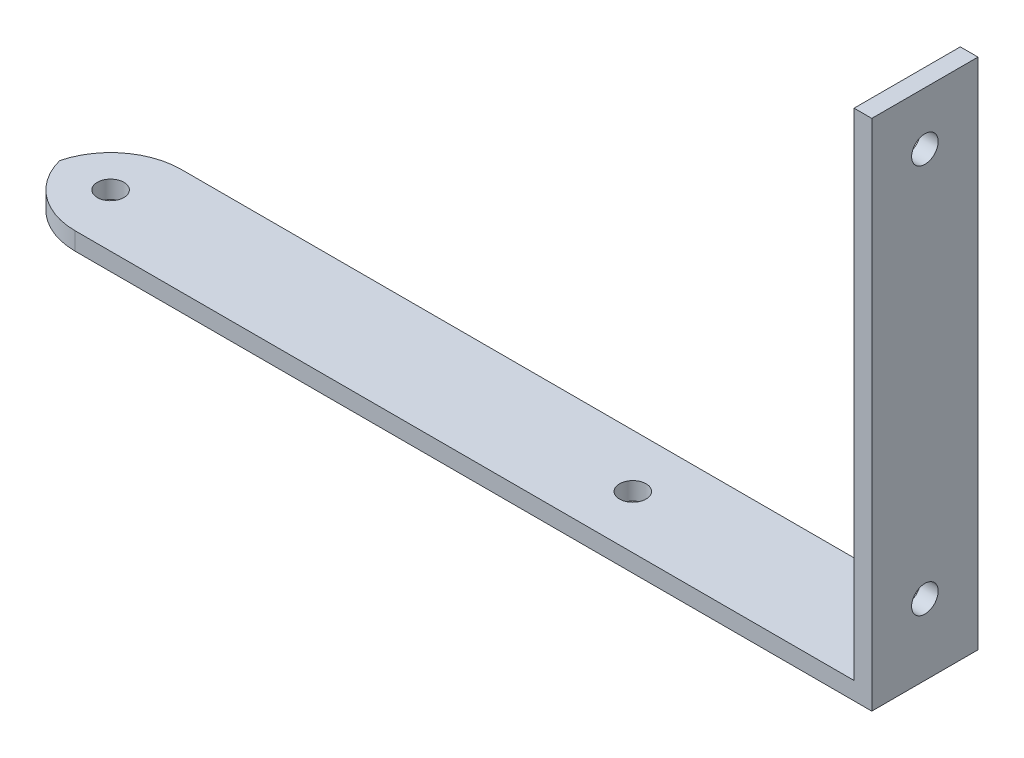
ISO-10303-21;
HEADER;
FILE_DESCRIPTION(('STEP AP214'),'2;1');
FILE_NAME('part.step','',(''),(''),'','','');
FILE_SCHEMA(('AUTOMOTIVE_DESIGN { 1 0 10303 214 1 1 1 1 }'));
ENDSEC;
DATA;
#1=APPLICATION_CONTEXT('core data for automotive mechanical design processes');
#2=APPLICATION_PROTOCOL_DEFINITION('international standard','automotive_design',2000,#1);
#3=PRODUCT_CONTEXT('',#1,'mechanical');
#4=PRODUCT('Part','Part','',(#3));
#5=PRODUCT_RELATED_PRODUCT_CATEGORY('part','',(#4));
#6=PRODUCT_DEFINITION_FORMATION('','',#4);
#7=PRODUCT_DEFINITION_CONTEXT('part definition',#1,'design');
#8=PRODUCT_DEFINITION('design','',#6,#7);
#9=PRODUCT_DEFINITION_SHAPE('','',#8);
#10=(LENGTH_UNIT() NAMED_UNIT(*) SI_UNIT(.MILLI.,.METRE.));
#11=(NAMED_UNIT(*) PLANE_ANGLE_UNIT() SI_UNIT($,.RADIAN.));
#12=(NAMED_UNIT(*) SI_UNIT($,.STERADIAN.) SOLID_ANGLE_UNIT());
#13=UNCERTAINTY_MEASURE_WITH_UNIT(LENGTH_MEASURE(1.E-05),#10,'distance_accuracy_value','');
#14=(GEOMETRIC_REPRESENTATION_CONTEXT(3) GLOBAL_UNCERTAINTY_ASSIGNED_CONTEXT((#13)) GLOBAL_UNIT_ASSIGNED_CONTEXT((#10,
#11,#12)) REPRESENTATION_CONTEXT('',''));
#15=CARTESIAN_POINT('',(0.,0.,0.));
#16=DIRECTION('',(0.,0.,1.));
#17=DIRECTION('',(1.,0.,0.));
#18=AXIS2_PLACEMENT_3D('',#15,#16,#17);
#19=CARTESIAN_POINT('',(0.,2.,0.));
#20=DIRECTION('',(0.,-1.,0.));
#21=DIRECTION('',(0.,0.,-1.));
#22=AXIS2_PLACEMENT_3D('',#19,#20,#21);
#23=PLANE('',#22);
#24=CARTESIAN_POINT('',(65.,2.,-6.));
#25=DIRECTION('',(0.,1.,0.));
#26=DIRECTION('',(0.,0.,1.));
#27=AXIS2_PLACEMENT_3D('',#24,#25,#26);
#28=CIRCLE('',#27,1.5);
#29=CARTESIAN_POINT('',(65.,2.,-4.5));
#30=VERTEX_POINT('',#29);
#31=EDGE_CURVE('E175',#30,#30,#28,.T.);
#32=ORIENTED_EDGE('',*,*,#31,.F.);
#33=EDGE_LOOP('',(#32));
#34=FACE_BOUND('',#33,.T.);
#35=CARTESIAN_POINT('',(6.,2.,-6.));
#36=DIRECTION('',(0.,1.,0.));
#37=DIRECTION('',(0.,0.,1.));
#38=AXIS2_PLACEMENT_3D('',#35,#36,#37);
#39=CIRCLE('',#38,1.5);
#40=CARTESIAN_POINT('',(6.,2.,-4.5));
#41=VERTEX_POINT('',#40);
#42=EDGE_CURVE('E123',#41,#41,#39,.T.);
#43=ORIENTED_EDGE('',*,*,#42,.F.);
#44=EDGE_LOOP('',(#43));
#45=FACE_BOUND('',#44,.T.);
#46=DIRECTION('',(-1.,0.,0.));
#47=VECTOR('',#46,1.);
#48=CARTESIAN_POINT('',(0.,2.,-12.));
#49=LINE('',#48,#47);
#50=CARTESIAN_POINT('',(96.,2.,-12.));
#51=VERTEX_POINT('',#50);
#52=CARTESIAN_POINT('',(8.,2.,-12.));
#53=VERTEX_POINT('',#52);
#54=EDGE_CURVE('E101',#51,#53,#49,.T.);
#55=ORIENTED_EDGE('',*,*,#54,.T.);
#56=CARTESIAN_POINT('',(8.,2.,-4.));
#57=DIRECTION('',(0.,-1.,0.));
#58=DIRECTION('',(0.,0.,-1.));
#59=AXIS2_PLACEMENT_3D('',#56,#57,#58);
#60=CIRCLE('',#59,8.);
#61=CARTESIAN_POINT('',(0.254033307585167,2.,-6.));
#62=VERTEX_POINT('',#61);
#63=EDGE_CURVE('E42',#53,#62,#60,.F.);
#64=ORIENTED_EDGE('',*,*,#63,.T.);
#65=CARTESIAN_POINT('',(8.,2.,-8.));
#66=DIRECTION('',(0.,-1.,0.));
#67=DIRECTION('',(0.,0.,-1.));
#68=AXIS2_PLACEMENT_3D('',#65,#66,#67);
#69=CIRCLE('',#68,8.);
#70=CARTESIAN_POINT('',(8.,2.,0.));
#71=VERTEX_POINT('',#70);
#72=EDGE_CURVE('E52',#62,#71,#69,.F.);
#73=ORIENTED_EDGE('',*,*,#72,.T.);
#74=DIRECTION('',(1.,0.,0.));
#75=VECTOR('',#74,1.);
#76=CARTESIAN_POINT('',(0.,2.,0.));
#77=LINE('',#76,#75);
#78=CARTESIAN_POINT('',(96.,2.,0.));
#79=VERTEX_POINT('',#78);
#80=EDGE_CURVE('E151',#71,#79,#77,.T.);
#81=ORIENTED_EDGE('',*,*,#80,.T.);
#82=DIRECTION('',(0.,0.,1.));
#83=VECTOR('',#82,1.);
#84=CARTESIAN_POINT('',(96.,2.,0.));
#85=LINE('',#84,#83);
#86=EDGE_CURVE('E117',#51,#79,#85,.T.);
#87=ORIENTED_EDGE('',*,*,#86,.F.);
#88=EDGE_LOOP('',(#55,#64,#73,#81,#87));
#89=FACE_BOUND('',#88,.T.);
#90=ADVANCED_FACE('F33',(#34,#45,#89),#23,.F.);
#91=CARTESIAN_POINT('',(0.,2.,0.));
#92=DIRECTION('',(0.,0.,-1.));
#93=DIRECTION('',(-1.,0.,0.));
#94=AXIS2_PLACEMENT_3D('',#91,#92,#93);
#95=PLANE('',#94);
#96=ORIENTED_EDGE('',*,*,#80,.F.);
#97=DIRECTION('',(0.,-1.,0.));
#98=VECTOR('',#97,1.);
#99=CARTESIAN_POINT('',(8.,2.,0.));
#100=LINE('',#99,#98);
#101=CARTESIAN_POINT('',(8.,0.,0.));
#102=VERTEX_POINT('',#101);
#103=EDGE_CURVE('E11',#71,#102,#100,.T.);
#104=ORIENTED_EDGE('',*,*,#103,.T.);
#105=DIRECTION('',(1.,0.,0.));
#106=VECTOR('',#105,1.);
#107=CARTESIAN_POINT('',(0.,0.,0.));
#108=LINE('',#107,#106);
#109=CARTESIAN_POINT('',(98.,0.,0.));
#110=VERTEX_POINT('',#109);
#111=EDGE_CURVE('E141',#102,#110,#108,.T.);
#112=ORIENTED_EDGE('',*,*,#111,.T.);
#113=DIRECTION('',(0.,-1.,0.));
#114=VECTOR('',#113,1.);
#115=CARTESIAN_POINT('',(98.,2.,0.));
#116=LINE('',#115,#114);
#117=CARTESIAN_POINT('',(98.,58.,0.));
#118=VERTEX_POINT('',#117);
#119=EDGE_CURVE('E100',#118,#110,#116,.T.);
#120=ORIENTED_EDGE('',*,*,#119,.F.);
#121=DIRECTION('',(1.,0.,0.));
#122=VECTOR('',#121,1.);
#123=CARTESIAN_POINT('',(98.,58.,0.));
#124=LINE('',#123,#122);
#125=CARTESIAN_POINT('',(96.,58.,0.));
#126=VERTEX_POINT('',#125);
#127=EDGE_CURVE('E116',#126,#118,#124,.T.);
#128=ORIENTED_EDGE('',*,*,#127,.F.);
#129=DIRECTION('',(0.,-1.,0.));
#130=VECTOR('',#129,1.);
#131=CARTESIAN_POINT('',(96.,58.,0.));
#132=LINE('',#131,#130);
#133=EDGE_CURVE('E128',#126,#79,#132,.T.);
#134=ORIENTED_EDGE('',*,*,#133,.T.);
#135=EDGE_LOOP('',(#96,#104,#112,#120,#128,#134));
#136=FACE_BOUND('',#135,.T.);
#137=ADVANCED_FACE('F172',(#136),#95,.F.);
#138=CARTESIAN_POINT('',(98.,2.,0.));
#139=DIRECTION('',(-1.,0.,0.));
#140=DIRECTION('',(0.,0.,1.));
#141=AXIS2_PLACEMENT_3D('',#138,#139,#140);
#142=PLANE('',#141);
#143=CARTESIAN_POINT('',(98.,52.,-6.));
#144=DIRECTION('',(-1.,0.,0.));
#145=DIRECTION('',(0.,0.,1.));
#146=AXIS2_PLACEMENT_3D('',#143,#144,#145);
#147=CIRCLE('',#146,1.5);
#148=CARTESIAN_POINT('',(98.,52.,-4.5));
#149=VERTEX_POINT('',#148);
#150=EDGE_CURVE('E186',#149,#149,#147,.T.);
#151=ORIENTED_EDGE('',*,*,#150,.T.);
#152=EDGE_LOOP('',(#151));
#153=FACE_BOUND('',#152,.T.);
#154=CARTESIAN_POINT('',(98.,8.,-6.));
#155=DIRECTION('',(-1.,0.,0.));
#156=DIRECTION('',(0.,0.,1.));
#157=AXIS2_PLACEMENT_3D('',#154,#155,#156);
#158=CIRCLE('',#157,1.5);
#159=CARTESIAN_POINT('',(98.,8.,-4.5));
#160=VERTEX_POINT('',#159);
#161=EDGE_CURVE('E176',#160,#160,#158,.T.);
#162=ORIENTED_EDGE('',*,*,#161,.T.);
#163=EDGE_LOOP('',(#162));
#164=FACE_BOUND('',#163,.T.);
#165=DIRECTION('',(0.,0.,-1.));
#166=VECTOR('',#165,1.);
#167=CARTESIAN_POINT('',(98.,0.,0.));
#168=LINE('',#167,#166);
#169=CARTESIAN_POINT('',(98.,0.,-12.));
#170=VERTEX_POINT('',#169);
#171=EDGE_CURVE('E96',#110,#170,#168,.T.);
#172=ORIENTED_EDGE('',*,*,#171,.T.);
#173=DIRECTION('',(0.,-1.,0.));
#174=VECTOR('',#173,1.);
#175=CARTESIAN_POINT('',(98.,2.,-12.));
#176=LINE('',#175,#174);
#177=CARTESIAN_POINT('',(98.,58.,-12.));
#178=VERTEX_POINT('',#177);
#179=EDGE_CURVE('E89',#178,#170,#176,.T.);
#180=ORIENTED_EDGE('',*,*,#179,.F.);
#181=DIRECTION('',(0.,0.,-1.));
#182=VECTOR('',#181,1.);
#183=CARTESIAN_POINT('',(98.,58.,0.));
#184=LINE('',#183,#182);
#185=EDGE_CURVE('E94',#118,#178,#184,.T.);
#186=ORIENTED_EDGE('',*,*,#185,.F.);
#187=ORIENTED_EDGE('',*,*,#119,.T.);
#188=EDGE_LOOP('',(#172,#180,#186,#187));
#189=FACE_BOUND('',#188,.T.);
#190=ADVANCED_FACE('F91',(#153,#164,#189),#142,.F.);
#191=CARTESIAN_POINT('',(0.,2.,-12.));
#192=DIRECTION('',(0.,0.,1.));
#193=DIRECTION('',(1.,0.,0.));
#194=AXIS2_PLACEMENT_3D('',#191,#192,#193);
#195=PLANE('',#194);
#196=DIRECTION('',(-1.,0.,0.));
#197=VECTOR('',#196,1.);
#198=CARTESIAN_POINT('',(0.,0.,-12.));
#199=LINE('',#198,#197);
#200=CARTESIAN_POINT('',(8.,0.,-12.));
#201=VERTEX_POINT('',#200);
#202=EDGE_CURVE('E153',#170,#201,#199,.T.);
#203=ORIENTED_EDGE('',*,*,#202,.T.);
#204=DIRECTION('',(0.,-1.,0.));
#205=VECTOR('',#204,1.);
#206=CARTESIAN_POINT('',(8.,2.,-12.));
#207=LINE('',#206,#205);
#208=EDGE_CURVE('E148',#201,#53,#207,.F.);
#209=ORIENTED_EDGE('',*,*,#208,.T.);
#210=ORIENTED_EDGE('',*,*,#54,.F.);
#211=DIRECTION('',(0.,-1.,0.));
#212=VECTOR('',#211,1.);
#213=CARTESIAN_POINT('',(96.,58.,-12.));
#214=LINE('',#213,#212);
#215=CARTESIAN_POINT('',(96.,58.,-12.));
#216=VERTEX_POINT('',#215);
#217=EDGE_CURVE('E108',#216,#51,#214,.T.);
#218=ORIENTED_EDGE('',*,*,#217,.F.);
#219=DIRECTION('',(-1.,0.,0.));
#220=VECTOR('',#219,1.);
#221=CARTESIAN_POINT('',(98.,58.,-12.));
#222=LINE('',#221,#220);
#223=EDGE_CURVE('E104',#178,#216,#222,.T.);
#224=ORIENTED_EDGE('',*,*,#223,.F.);
#225=ORIENTED_EDGE('',*,*,#179,.T.);
#226=EDGE_LOOP('',(#203,#209,#210,#218,#224,#225));
#227=FACE_BOUND('',#226,.T.);
#228=ADVANCED_FACE('F105',(#227),#195,.F.);
#229=CARTESIAN_POINT('',(0.,0.,0.));
#230=DIRECTION('',(0.,-1.,0.));
#231=DIRECTION('',(0.,0.,-1.));
#232=AXIS2_PLACEMENT_3D('',#229,#230,#231);
#233=PLANE('',#232);
#234=CARTESIAN_POINT('',(65.,0.,-6.));
#235=DIRECTION('',(0.,1.,0.));
#236=DIRECTION('',(0.,0.,1.));
#237=AXIS2_PLACEMENT_3D('',#234,#235,#236);
#238=CIRCLE('',#237,1.5);
#239=CARTESIAN_POINT('',(65.,0.,-4.5));
#240=VERTEX_POINT('',#239);
#241=EDGE_CURVE('E178',#240,#240,#238,.T.);
#242=ORIENTED_EDGE('',*,*,#241,.T.);
#243=EDGE_LOOP('',(#242));
#244=FACE_BOUND('',#243,.T.);
#245=CARTESIAN_POINT('',(6.,0.,-6.));
#246=DIRECTION('',(0.,1.,0.));
#247=DIRECTION('',(0.,0.,1.));
#248=AXIS2_PLACEMENT_3D('',#245,#246,#247);
#249=CIRCLE('',#248,1.5);
#250=CARTESIAN_POINT('',(6.,0.,-4.5));
#251=VERTEX_POINT('',#250);
#252=EDGE_CURVE('E120',#251,#251,#249,.T.);
#253=ORIENTED_EDGE('',*,*,#252,.T.);
#254=EDGE_LOOP('',(#253));
#255=FACE_BOUND('',#254,.T.);
#256=CARTESIAN_POINT('',(8.,0.,-8.));
#257=DIRECTION('',(0.,-1.,0.));
#258=DIRECTION('',(0.,0.,-1.));
#259=AXIS2_PLACEMENT_3D('',#256,#257,#258);
#260=CIRCLE('',#259,8.);
#261=CARTESIAN_POINT('',(0.254033307585167,0.,-6.));
#262=VERTEX_POINT('',#261);
#263=EDGE_CURVE('E144',#102,#262,#260,.T.);
#264=ORIENTED_EDGE('',*,*,#263,.T.);
#265=CARTESIAN_POINT('',(8.,0.,-4.));
#266=DIRECTION('',(0.,-1.,0.));
#267=DIRECTION('',(0.,0.,-1.));
#268=AXIS2_PLACEMENT_3D('',#265,#266,#267);
#269=CIRCLE('',#268,8.);
#270=EDGE_CURVE('E146',#262,#201,#269,.T.);
#271=ORIENTED_EDGE('',*,*,#270,.T.);
#272=ORIENTED_EDGE('',*,*,#202,.F.);
#273=ORIENTED_EDGE('',*,*,#171,.F.);
#274=ORIENTED_EDGE('',*,*,#111,.F.);
#275=EDGE_LOOP('',(#264,#271,#272,#273,#274));
#276=FACE_BOUND('',#275,.T.);
#277=ADVANCED_FACE('F162',(#244,#255,#276),#233,.T.);
#278=CARTESIAN_POINT('',(96.,58.,0.));
#279=DIRECTION('',(1.,0.,0.));
#280=DIRECTION('',(0.,0.,-1.));
#281=AXIS2_PLACEMENT_3D('',#278,#279,#280);
#282=PLANE('',#281);
#283=CARTESIAN_POINT('',(96.,52.,-6.));
#284=DIRECTION('',(-1.,0.,0.));
#285=DIRECTION('',(0.,0.,1.));
#286=AXIS2_PLACEMENT_3D('',#283,#284,#285);
#287=CIRCLE('',#286,1.5);
#288=CARTESIAN_POINT('',(96.,52.,-4.5));
#289=VERTEX_POINT('',#288);
#290=EDGE_CURVE('E189',#289,#289,#287,.T.);
#291=ORIENTED_EDGE('',*,*,#290,.F.);
#292=EDGE_LOOP('',(#291));
#293=FACE_BOUND('',#292,.T.);
#294=CARTESIAN_POINT('',(96.,8.,-6.));
#295=DIRECTION('',(-1.,0.,0.));
#296=DIRECTION('',(0.,0.,1.));
#297=AXIS2_PLACEMENT_3D('',#294,#295,#296);
#298=CIRCLE('',#297,1.5);
#299=CARTESIAN_POINT('',(96.,8.,-4.5));
#300=VERTEX_POINT('',#299);
#301=EDGE_CURVE('E181',#300,#300,#298,.T.);
#302=ORIENTED_EDGE('',*,*,#301,.F.);
#303=EDGE_LOOP('',(#302));
#304=FACE_BOUND('',#303,.T.);
#305=ORIENTED_EDGE('',*,*,#86,.T.);
#306=ORIENTED_EDGE('',*,*,#133,.F.);
#307=DIRECTION('',(0.,0.,1.));
#308=VECTOR('',#307,1.);
#309=CARTESIAN_POINT('',(96.,58.,0.));
#310=LINE('',#309,#308);
#311=EDGE_CURVE('E111',#216,#126,#310,.T.);
#312=ORIENTED_EDGE('',*,*,#311,.F.);
#313=ORIENTED_EDGE('',*,*,#217,.T.);
#314=EDGE_LOOP('',(#305,#306,#312,#313));
#315=FACE_BOUND('',#314,.T.);
#316=ADVANCED_FACE('F171',(#293,#304,#315),#282,.F.);
#317=CARTESIAN_POINT('',(0.,58.,0.));
#318=DIRECTION('',(0.,1.,0.));
#319=DIRECTION('',(0.,0.,1.));
#320=AXIS2_PLACEMENT_3D('',#317,#318,#319);
#321=PLANE('',#320);
#322=ORIENTED_EDGE('',*,*,#185,.T.);
#323=ORIENTED_EDGE('',*,*,#223,.T.);
#324=ORIENTED_EDGE('',*,*,#311,.T.);
#325=ORIENTED_EDGE('',*,*,#127,.T.);
#326=EDGE_LOOP('',(#322,#323,#324,#325));
#327=FACE_BOUND('',#326,.T.);
#328=ADVANCED_FACE('F114',(#327),#321,.T.);
#329=CARTESIAN_POINT('',(6.,0.,-6.));
#330=DIRECTION('',(0.,1.,0.));
#331=DIRECTION('',(0.,0.,1.));
#332=AXIS2_PLACEMENT_3D('',#329,#330,#331);
#333=CYLINDRICAL_SURFACE('',#332,1.5);
#334=ORIENTED_EDGE('',*,*,#252,.F.);
#335=EDGE_LOOP('',(#334));
#336=FACE_BOUND('',#335,.T.);
#337=ORIENTED_EDGE('',*,*,#42,.T.);
#338=EDGE_LOOP('',(#337));
#339=FACE_BOUND('',#338,.T.);
#340=ADVANCED_FACE('F199',(#336,#339),#333,.F.);
#341=CARTESIAN_POINT('',(65.,0.,-6.));
#342=DIRECTION('',(0.,1.,0.));
#343=DIRECTION('',(0.,0.,1.));
#344=AXIS2_PLACEMENT_3D('',#341,#342,#343);
#345=CYLINDRICAL_SURFACE('',#344,1.5);
#346=ORIENTED_EDGE('',*,*,#241,.F.);
#347=EDGE_LOOP('',(#346));
#348=FACE_BOUND('',#347,.T.);
#349=ORIENTED_EDGE('',*,*,#31,.T.);
#350=EDGE_LOOP('',(#349));
#351=FACE_BOUND('',#350,.T.);
#352=ADVANCED_FACE('F228',(#348,#351),#345,.F.);
#353=CARTESIAN_POINT('',(8.,2.,-8.));
#354=DIRECTION('',(0.,-1.,0.));
#355=DIRECTION('',(0.,0.,-1.));
#356=AXIS2_PLACEMENT_3D('',#353,#354,#355);
#357=CYLINDRICAL_SURFACE('',#356,8.);
#358=ORIENTED_EDGE('',*,*,#103,.F.);
#359=ORIENTED_EDGE('',*,*,#72,.F.);
#360=DIRECTION('',(0.,-1.,0.));
#361=VECTOR('',#360,1.);
#362=CARTESIAN_POINT('',(0.254033307585167,1.,-6.));
#363=LINE('',#362,#361);
#364=EDGE_CURVE('E37',#262,#62,#363,.F.);
#365=ORIENTED_EDGE('',*,*,#364,.F.);
#366=ORIENTED_EDGE('',*,*,#263,.F.);
#367=EDGE_LOOP('',(#358,#359,#365,#366));
#368=FACE_BOUND('',#367,.T.);
#369=ADVANCED_FACE('F35',(#368),#357,.T.);
#370=CARTESIAN_POINT('',(8.,2.,-4.));
#371=DIRECTION('',(0.,-1.,0.));
#372=DIRECTION('',(0.,0.,-1.));
#373=AXIS2_PLACEMENT_3D('',#370,#371,#372);
#374=CYLINDRICAL_SURFACE('',#373,8.);
#375=ORIENTED_EDGE('',*,*,#63,.F.);
#376=ORIENTED_EDGE('',*,*,#208,.F.);
#377=ORIENTED_EDGE('',*,*,#270,.F.);
#378=ORIENTED_EDGE('',*,*,#364,.T.);
#379=EDGE_LOOP('',(#375,#376,#377,#378));
#380=FACE_BOUND('',#379,.T.);
#381=ADVANCED_FACE('F168',(#380),#374,.T.);
#382=CARTESIAN_POINT('',(98.,8.,-6.));
#383=DIRECTION('',(-1.,0.,0.));
#384=DIRECTION('',(0.,0.,1.));
#385=AXIS2_PLACEMENT_3D('',#382,#383,#384);
#386=CYLINDRICAL_SURFACE('',#385,1.5);
#387=ORIENTED_EDGE('',*,*,#161,.F.);
#388=EDGE_LOOP('',(#387));
#389=FACE_BOUND('',#388,.T.);
#390=ORIENTED_EDGE('',*,*,#301,.T.);
#391=EDGE_LOOP('',(#390));
#392=FACE_BOUND('',#391,.T.);
#393=ADVANCED_FACE('F220',(#389,#392),#386,.F.);
#394=CARTESIAN_POINT('',(98.,52.,-6.));
#395=DIRECTION('',(-1.,0.,0.));
#396=DIRECTION('',(0.,0.,1.));
#397=AXIS2_PLACEMENT_3D('',#394,#395,#396);
#398=CYLINDRICAL_SURFACE('',#397,1.5);
#399=ORIENTED_EDGE('',*,*,#150,.F.);
#400=EDGE_LOOP('',(#399));
#401=FACE_BOUND('',#400,.T.);
#402=ORIENTED_EDGE('',*,*,#290,.T.);
#403=EDGE_LOOP('',(#402));
#404=FACE_BOUND('',#403,.T.);
#405=ADVANCED_FACE('F225',(#401,#404),#398,.F.);
#406=CLOSED_SHELL('',(#90,#137,#190,#228,#277,#316,#328,#340,#352,#369,#381,#393,#405));
#407=MANIFOLD_SOLID_BREP('B2',#406);
#408=ADVANCED_BREP_SHAPE_REPRESENTATION('',(#18,#407),#14);
#409=SHAPE_DEFINITION_REPRESENTATION(#9,#408);
ENDSEC;
END-ISO-10303-21;
